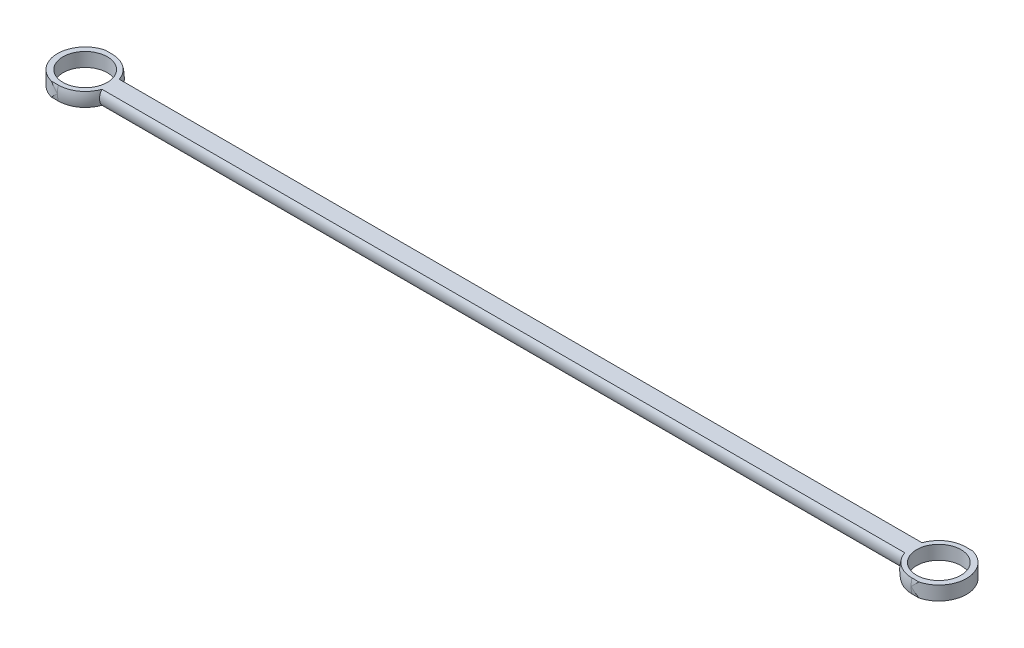
ISO-10303-21;
HEADER;
FILE_DESCRIPTION(('STEP AP214'),'2;1');
FILE_NAME('part.step','',(''),(''),'','','');
FILE_SCHEMA(('AUTOMOTIVE_DESIGN { 1 0 10303 214 1 1 1 1 }'));
ENDSEC;
DATA;
#1=APPLICATION_CONTEXT('core data for automotive mechanical design processes');
#2=APPLICATION_PROTOCOL_DEFINITION('international standard','automotive_design',2000,#1);
#3=PRODUCT_CONTEXT('',#1,'mechanical');
#4=PRODUCT('Part','Part','',(#3));
#5=PRODUCT_RELATED_PRODUCT_CATEGORY('part','',(#4));
#6=PRODUCT_DEFINITION_FORMATION('','',#4);
#7=PRODUCT_DEFINITION_CONTEXT('part definition',#1,'design');
#8=PRODUCT_DEFINITION('design','',#6,#7);
#9=PRODUCT_DEFINITION_SHAPE('','',#8);
#10=(LENGTH_UNIT() NAMED_UNIT(*) SI_UNIT(.MILLI.,.METRE.));
#11=(NAMED_UNIT(*) PLANE_ANGLE_UNIT() SI_UNIT($,.RADIAN.));
#12=(NAMED_UNIT(*) SI_UNIT($,.STERADIAN.) SOLID_ANGLE_UNIT());
#13=UNCERTAINTY_MEASURE_WITH_UNIT(LENGTH_MEASURE(1.E-05),#10,'distance_accuracy_value','');
#14=(GEOMETRIC_REPRESENTATION_CONTEXT(3) GLOBAL_UNCERTAINTY_ASSIGNED_CONTEXT((#13)) GLOBAL_UNIT_ASSIGNED_CONTEXT((#10,
#11,#12)) REPRESENTATION_CONTEXT('',''));
#15=CARTESIAN_POINT('',(0.,0.,0.));
#16=DIRECTION('',(0.,0.,1.));
#17=DIRECTION('',(1.,0.,0.));
#18=AXIS2_PLACEMENT_3D('',#15,#16,#17);
#19=CARTESIAN_POINT('',(180.,-1.25,0.));
#20=DIRECTION('',(0.,1.,0.));
#21=DIRECTION('',(0.,0.,1.));
#22=AXIS2_PLACEMENT_3D('',#19,#20,#21);
#23=PLANE('',#22);
#24=CARTESIAN_POINT('',(13.074176,-1.25,0.));
#25=DIRECTION('',(0.,1.,0.));
#26=DIRECTION('',(0.,0.,1.));
#27=AXIS2_PLACEMENT_3D('',#24,#25,#26);
#28=CIRCLE('',#27,4.);
#29=CARTESIAN_POINT('',(13.074176,-1.25,-3.99999999999998));
#30=VERTEX_POINT('',#29);
#31=EDGE_CURVE('E271',#30,#30,#28,.F.);
#32=ORIENTED_EDGE('',*,*,#31,.F.);
#33=EDGE_LOOP('',(#32));
#34=FACE_BOUND('',#33,.T.);
#35=CARTESIAN_POINT('',(13.074176,-1.25,0.));
#36=DIRECTION('',(0.,1.,0.));
#37=DIRECTION('',(0.,0.,1.));
#38=AXIS2_PLACEMENT_3D('',#35,#36,#37);
#39=CIRCLE('',#38,4.84122918275926);
#40=CARTESIAN_POINT('',(17.6567516949559,-1.24999999999999,-1.56124949959958));
#41=VERTEX_POINT('',#40);
#42=CARTESIAN_POINT('',(13.074176,-1.24999999999999,-4.84122918275924));
#43=VERTEX_POINT('',#42);
#44=EDGE_CURVE('E258',#41,#43,#39,.T.);
#45=ORIENTED_EDGE('',*,*,#44,.F.);
#46=DIRECTION('',(-1.,0.,0.));
#47=VECTOR('',#46,1.);
#48=CARTESIAN_POINT('',(18.074176,-1.25,-1.56124949959958));
#49=LINE('',#48,#47);
#50=CARTESIAN_POINT('',(162.343248305044,-1.24999999999999,-1.56124949959958));
#51=VERTEX_POINT('',#50);
#52=EDGE_CURVE('E247',#41,#51,#49,.F.);
#53=ORIENTED_EDGE('',*,*,#52,.T.);
#54=CARTESIAN_POINT('',(166.925824,-1.25,0.));
#55=DIRECTION('',(0.,-1.,0.));
#56=DIRECTION('',(0.,0.,1.));
#57=AXIS2_PLACEMENT_3D('',#54,#55,#56);
#58=CIRCLE('',#57,4.84122918275926);
#59=CARTESIAN_POINT('',(166.925824,-1.24999999999999,-4.84122918275924));
#60=VERTEX_POINT('',#59);
#61=EDGE_CURVE('E213',#51,#60,#58,.T.);
#62=ORIENTED_EDGE('',*,*,#61,.T.);
#63=DIRECTION('',(1.,0.,0.));
#64=VECTOR('',#63,1.);
#65=CARTESIAN_POINT('',(1.11022302462516E-13,-1.25,-4.84122918275927));
#66=LINE('',#65,#64);
#67=CARTESIAN_POINT('',(168.175824,-1.25,-4.84122918275927));
#68=VERTEX_POINT('',#67);
#69=EDGE_CURVE('E199',#60,#68,#66,.T.);
#70=ORIENTED_EDGE('',*,*,#69,.T.);
#71=CARTESIAN_POINT('',(166.925824,-1.25,0.));
#72=DIRECTION('',(0.,-1.,0.));
#73=DIRECTION('',(0.,0.,1.));
#74=AXIS2_PLACEMENT_3D('',#71,#72,#73);
#75=CIRCLE('',#74,5.);
#76=CARTESIAN_POINT('',(168.175824,-1.25,4.84122918275927));
#77=VERTEX_POINT('',#76);
#78=EDGE_CURVE('E219',#77,#68,#75,.F.);
#79=ORIENTED_EDGE('',*,*,#78,.F.);
#80=DIRECTION('',(1.,0.,0.));
#81=VECTOR('',#80,1.);
#82=CARTESIAN_POINT('',(1.11022302462516E-13,-1.25,4.84122918275927));
#83=LINE('',#82,#81);
#84=CARTESIAN_POINT('',(166.925824,-1.25,4.84122918275928));
#85=VERTEX_POINT('',#84);
#86=EDGE_CURVE('E197',#85,#77,#83,.T.);
#87=ORIENTED_EDGE('',*,*,#86,.F.);
#88=CARTESIAN_POINT('',(162.343248305044,-1.25,1.5612494995996));
#89=VERTEX_POINT('',#88);
#90=EDGE_CURVE('E204',#85,#89,#58,.T.);
#91=ORIENTED_EDGE('',*,*,#90,.T.);
#92=DIRECTION('',(-1.,0.,0.));
#93=VECTOR('',#92,1.);
#94=CARTESIAN_POINT('',(18.074176,-1.25,1.56124949959961));
#95=LINE('',#94,#93);
#96=CARTESIAN_POINT('',(17.6567516949559,-1.25,1.5612494995996));
#97=VERTEX_POINT('',#96);
#98=EDGE_CURVE('E251',#89,#97,#95,.T.);
#99=ORIENTED_EDGE('',*,*,#98,.T.);
#100=CARTESIAN_POINT('',(13.074176,-1.25,4.84122918275928));
#101=VERTEX_POINT('',#100);
#102=EDGE_CURVE('E260',#101,#97,#39,.T.);
#103=ORIENTED_EDGE('',*,*,#102,.F.);
#104=DIRECTION('',(-1.,0.,0.));
#105=VECTOR('',#104,1.);
#106=CARTESIAN_POINT('',(180.,-1.25,4.84122918275927));
#107=LINE('',#106,#105);
#108=CARTESIAN_POINT('',(11.8241760000001,-1.25,4.84122918275927));
#109=VERTEX_POINT('',#108);
#110=EDGE_CURVE('E79',#101,#109,#107,.T.);
#111=ORIENTED_EDGE('',*,*,#110,.T.);
#112=CARTESIAN_POINT('',(13.074176,-1.25,0.));
#113=DIRECTION('',(0.,1.,0.));
#114=DIRECTION('',(0.,0.,1.));
#115=AXIS2_PLACEMENT_3D('',#112,#113,#114);
#116=CIRCLE('',#115,5.);
#117=CARTESIAN_POINT('',(11.8241760000001,-1.25,-4.84122918275927));
#118=VERTEX_POINT('',#117);
#119=EDGE_CURVE('E267',#109,#118,#116,.F.);
#120=ORIENTED_EDGE('',*,*,#119,.T.);
#121=DIRECTION('',(-1.,0.,0.));
#122=VECTOR('',#121,1.);
#123=CARTESIAN_POINT('',(180.,-1.25,-4.84122918275927));
#124=LINE('',#123,#122);
#125=EDGE_CURVE('E87',#43,#118,#124,.T.);
#126=ORIENTED_EDGE('',*,*,#125,.F.);
#127=EDGE_LOOP('',(#45,#53,#62,#70,#79,#87,#91,#99,#103,#111,#120,#126));
#128=FACE_BOUND('',#127,.T.);
#129=CARTESIAN_POINT('',(166.925824,-1.25,0.));
#130=DIRECTION('',(0.,-1.,0.));
#131=DIRECTION('',(0.,0.,1.));
#132=AXIS2_PLACEMENT_3D('',#129,#130,#131);
#133=CIRCLE('',#132,4.);
#134=CARTESIAN_POINT('',(166.925824,-1.25,-3.99999999999998));
#135=VERTEX_POINT('',#134);
#136=EDGE_CURVE('E225',#135,#135,#133,.F.);
#137=ORIENTED_EDGE('',*,*,#136,.T.);
#138=EDGE_LOOP('',(#137));
#139=FACE_BOUND('',#138,.T.);
#140=ADVANCED_FACE('F64',(#34,#128,#139),#23,.F.);
#141=CARTESIAN_POINT('',(180.,0.,0.));
#142=DIRECTION('',(-1.,0.,0.));
#143=DIRECTION('',(0.,0.,1.));
#144=AXIS2_PLACEMENT_3D('',#141,#142,#143);
#145=CYLINDRICAL_SURFACE('',#144,5.);
#146=CARTESIAN_POINT('',(13.074176,0.,0.));
#147=DIRECTION('',(-1.,0.,0.));
#148=DIRECTION('',(0.,0.,1.));
#149=AXIS2_PLACEMENT_3D('',#146,#147,#148);
#150=CIRCLE('',#149,4.99999999999999);
#151=CARTESIAN_POINT('',(13.074176,0.,-4.99999999999997));
#152=VERTEX_POINT('',#151);
#153=EDGE_CURVE('E303',#152,#43,#150,.T.);
#154=ORIENTED_EDGE('',*,*,#153,.T.);
#155=ORIENTED_EDGE('',*,*,#125,.T.);
#156=CARTESIAN_POINT('',(13.0741760000001,0.,0.));
#157=DIRECTION('',(-0.707106781186547,0.707106781186548,0.));
#158=DIRECTION('',(-0.707106781186547,-0.707106781186548,0.));
#159=AXIS2_PLACEMENT_3D('',#156,#157,#158);
#160=ELLIPSE('',#159,7.07106781186547,5.);
#161=EDGE_CURVE('E269',#118,#152,#160,.F.);
#162=ORIENTED_EDGE('',*,*,#161,.T.);
#163=EDGE_LOOP('',(#154,#155,#162));
#164=FACE_BOUND('',#163,.T.);
#165=ADVANCED_FACE('F304',(#164),#145,.T.);
#166=CARTESIAN_POINT('',(13.074176,1.25,-4.84122918275924));
#167=VERTEX_POINT('',#166);
#168=EDGE_CURVE('E241',#167,#152,#150,.T.);
#169=ORIENTED_EDGE('',*,*,#168,.T.);
#170=CARTESIAN_POINT('',(13.0741760000001,0.,0.));
#171=DIRECTION('',(-0.707106781186547,-0.707106781186548,0.));
#172=DIRECTION('',(-0.707106781186547,0.707106781186548,0.));
#173=AXIS2_PLACEMENT_3D('',#170,#171,#172);
#174=ELLIPSE('',#173,7.07106781186547,5.);
#175=CARTESIAN_POINT('',(11.8241760000001,1.25,-4.84122918275927));
#176=VERTEX_POINT('',#175);
#177=EDGE_CURVE('E264',#152,#176,#174,.F.);
#178=ORIENTED_EDGE('',*,*,#177,.T.);
#179=DIRECTION('',(-1.,0.,0.));
#180=VECTOR('',#179,1.);
#181=CARTESIAN_POINT('',(180.,1.25,-4.84122918275927));
#182=LINE('',#181,#180);
#183=EDGE_CURVE('E277',#167,#176,#182,.T.);
#184=ORIENTED_EDGE('',*,*,#183,.F.);
#185=EDGE_LOOP('',(#169,#178,#184));
#186=FACE_BOUND('',#185,.T.);
#187=ADVANCED_FACE('F301',(#186),#145,.T.);
#188=CARTESIAN_POINT('',(180.,1.25,0.));
#189=DIRECTION('',(0.,1.,0.));
#190=DIRECTION('',(0.,0.,1.));
#191=AXIS2_PLACEMENT_3D('',#188,#189,#190);
#192=PLANE('',#191);
#193=CARTESIAN_POINT('',(13.074176,1.25,0.));
#194=DIRECTION('',(0.,1.,0.));
#195=DIRECTION('',(0.,0.,1.));
#196=AXIS2_PLACEMENT_3D('',#193,#194,#195);
#197=CIRCLE('',#196,4.);
#198=CARTESIAN_POINT('',(13.074176,1.25,-3.99999999999998));
#199=VERTEX_POINT('',#198);
#200=EDGE_CURVE('E67',#199,#199,#197,.F.);
#201=ORIENTED_EDGE('',*,*,#200,.T.);
#202=EDGE_LOOP('',(#201));
#203=FACE_BOUND('',#202,.T.);
#204=DIRECTION('',(-1.,0.,0.));
#205=VECTOR('',#204,1.);
#206=CARTESIAN_POINT('',(18.074176,1.25,-1.56124949959958));
#207=LINE('',#206,#205);
#208=CARTESIAN_POINT('',(17.6567516949559,1.24999999999999,-1.56124949959958));
#209=VERTEX_POINT('',#208);
#210=CARTESIAN_POINT('',(162.343248305044,1.24999999999999,-1.56124949959958));
#211=VERTEX_POINT('',#210);
#212=EDGE_CURVE('E245',#209,#211,#207,.F.);
#213=ORIENTED_EDGE('',*,*,#212,.F.);
#214=CARTESIAN_POINT('',(13.074176,1.25,0.));
#215=DIRECTION('',(0.,1.,0.));
#216=DIRECTION('',(0.,0.,1.));
#217=AXIS2_PLACEMENT_3D('',#214,#215,#216);
#218=CIRCLE('',#217,4.84122918275926);
#219=EDGE_CURVE('E254',#209,#167,#218,.T.);
#220=ORIENTED_EDGE('',*,*,#219,.T.);
#221=ORIENTED_EDGE('',*,*,#183,.T.);
#222=CARTESIAN_POINT('',(13.074176,1.25,0.));
#223=DIRECTION('',(0.,1.,0.));
#224=DIRECTION('',(0.,0.,1.));
#225=AXIS2_PLACEMENT_3D('',#222,#223,#224);
#226=CIRCLE('',#225,5.);
#227=CARTESIAN_POINT('',(11.8241760000001,1.25,4.84122918275927));
#228=VERTEX_POINT('',#227);
#229=EDGE_CURVE('E261',#228,#176,#226,.F.);
#230=ORIENTED_EDGE('',*,*,#229,.F.);
#231=DIRECTION('',(-1.,0.,0.));
#232=VECTOR('',#231,1.);
#233=CARTESIAN_POINT('',(180.,1.25,4.84122918275927));
#234=LINE('',#233,#232);
#235=CARTESIAN_POINT('',(13.074176,1.25,4.84122918275928));
#236=VERTEX_POINT('',#235);
#237=EDGE_CURVE('E275',#236,#228,#234,.T.);
#238=ORIENTED_EDGE('',*,*,#237,.F.);
#239=CARTESIAN_POINT('',(17.6567516949559,1.25,1.5612494995996));
#240=VERTEX_POINT('',#239);
#241=EDGE_CURVE('E257',#236,#240,#218,.T.);
#242=ORIENTED_EDGE('',*,*,#241,.T.);
#243=DIRECTION('',(-1.,0.,0.));
#244=VECTOR('',#243,1.);
#245=CARTESIAN_POINT('',(18.074176,1.25,1.56124949959961));
#246=LINE('',#245,#244);
#247=CARTESIAN_POINT('',(162.343248305044,1.25,1.5612494995996));
#248=VERTEX_POINT('',#247);
#249=EDGE_CURVE('E249',#248,#240,#246,.T.);
#250=ORIENTED_EDGE('',*,*,#249,.F.);
#251=CARTESIAN_POINT('',(166.925824,1.25,0.));
#252=DIRECTION('',(0.,-1.,0.));
#253=DIRECTION('',(0.,0.,1.));
#254=AXIS2_PLACEMENT_3D('',#251,#252,#253);
#255=CIRCLE('',#254,4.84122918275926);
#256=CARTESIAN_POINT('',(166.925824,1.25,4.84122918275928));
#257=VERTEX_POINT('',#256);
#258=EDGE_CURVE('E212',#257,#248,#255,.T.);
#259=ORIENTED_EDGE('',*,*,#258,.F.);
#260=DIRECTION('',(1.,0.,0.));
#261=VECTOR('',#260,1.);
#262=CARTESIAN_POINT('',(1.11022302462516E-13,1.25,4.84122918275927));
#263=LINE('',#262,#261);
#264=CARTESIAN_POINT('',(168.175824,1.25,4.84122918275927));
#265=VERTEX_POINT('',#264);
#266=EDGE_CURVE('E184',#257,#265,#263,.T.);
#267=ORIENTED_EDGE('',*,*,#266,.T.);
#268=CARTESIAN_POINT('',(166.925824,1.25,0.));
#269=DIRECTION('',(0.,-1.,0.));
#270=DIRECTION('',(0.,0.,1.));
#271=AXIS2_PLACEMENT_3D('',#268,#269,#270);
#272=CIRCLE('',#271,5.);
#273=CARTESIAN_POINT('',(168.175824,1.25,-4.84122918275927));
#274=VERTEX_POINT('',#273);
#275=EDGE_CURVE('E176',#265,#274,#272,.F.);
#276=ORIENTED_EDGE('',*,*,#275,.T.);
#277=DIRECTION('',(1.,0.,0.));
#278=VECTOR('',#277,1.);
#279=CARTESIAN_POINT('',(1.11022302462516E-13,1.25,-4.84122918275927));
#280=LINE('',#279,#278);
#281=CARTESIAN_POINT('',(166.925824,1.25,-4.84122918275924));
#282=VERTEX_POINT('',#281);
#283=EDGE_CURVE('E230',#282,#274,#280,.T.);
#284=ORIENTED_EDGE('',*,*,#283,.F.);
#285=EDGE_CURVE('E210',#211,#282,#255,.T.);
#286=ORIENTED_EDGE('',*,*,#285,.F.);
#287=EDGE_LOOP('',(#213,#220,#221,#230,#238,#242,#250,#259,#267,#276,#284,#286));
#288=FACE_BOUND('',#287,.T.);
#289=CARTESIAN_POINT('',(166.925824,1.25,0.));
#290=DIRECTION('',(0.,-1.,0.));
#291=DIRECTION('',(0.,0.,1.));
#292=AXIS2_PLACEMENT_3D('',#289,#290,#291);
#293=CIRCLE('',#292,4.);
#294=CARTESIAN_POINT('',(166.925824,1.25,-3.99999999999998));
#295=VERTEX_POINT('',#294);
#296=EDGE_CURVE('E224',#295,#295,#293,.F.);
#297=ORIENTED_EDGE('',*,*,#296,.F.);
#298=EDGE_LOOP('',(#297));
#299=FACE_BOUND('',#298,.T.);
#300=ADVANCED_FACE('F295',(#203,#288,#299),#192,.T.);
#301=CARTESIAN_POINT('',(180.,0.,0.));
#302=DIRECTION('',(-1.,0.,0.));
#303=DIRECTION('',(0.,0.,1.));
#304=AXIS2_PLACEMENT_3D('',#301,#302,#303);
#305=CYLINDRICAL_SURFACE('',#304,5.);
#306=CARTESIAN_POINT('',(13.074176,0.,5.00000000000001));
#307=VERTEX_POINT('',#306);
#308=EDGE_CURVE('E180',#101,#307,#150,.T.);
#309=ORIENTED_EDGE('',*,*,#308,.T.);
#310=CARTESIAN_POINT('',(13.0741760000001,0.,0.));
#311=DIRECTION('',(-0.707106781186547,0.707106781186548,0.));
#312=DIRECTION('',(-0.707106781186547,-0.707106781186548,0.));
#313=AXIS2_PLACEMENT_3D('',#310,#311,#312);
#314=ELLIPSE('',#313,7.07106781186547,5.);
#315=EDGE_CURVE('E72',#307,#109,#314,.F.);
#316=ORIENTED_EDGE('',*,*,#315,.T.);
#317=ORIENTED_EDGE('',*,*,#110,.F.);
#318=EDGE_LOOP('',(#309,#316,#317));
#319=FACE_BOUND('',#318,.T.);
#320=ADVANCED_FACE('F284',(#319),#305,.T.);
#321=EDGE_CURVE('E237',#307,#236,#150,.T.);
#322=ORIENTED_EDGE('',*,*,#321,.T.);
#323=ORIENTED_EDGE('',*,*,#237,.T.);
#324=CARTESIAN_POINT('',(13.0741760000001,0.,0.));
#325=DIRECTION('',(-0.707106781186547,-0.707106781186548,0.));
#326=DIRECTION('',(-0.707106781186547,0.707106781186548,0.));
#327=AXIS2_PLACEMENT_3D('',#324,#325,#326);
#328=ELLIPSE('',#327,7.07106781186547,5.);
#329=EDGE_CURVE('E12',#228,#307,#328,.F.);
#330=ORIENTED_EDGE('',*,*,#329,.T.);
#331=EDGE_LOOP('',(#322,#323,#330));
#332=FACE_BOUND('',#331,.T.);
#333=ADVANCED_FACE('F290',(#332),#305,.T.);
#334=CARTESIAN_POINT('',(13.074176,170.,0.));
#335=DIRECTION('',(0.,-1.,0.));
#336=DIRECTION('',(0.,0.,-1.));
#337=AXIS2_PLACEMENT_3D('',#334,#335,#336);
#338=CYLINDRICAL_SURFACE('',#337,5.);
#339=ORIENTED_EDGE('',*,*,#119,.F.);
#340=ORIENTED_EDGE('',*,*,#315,.F.);
#341=ORIENTED_EDGE('',*,*,#329,.F.);
#342=ORIENTED_EDGE('',*,*,#229,.T.);
#343=ORIENTED_EDGE('',*,*,#177,.F.);
#344=ORIENTED_EDGE('',*,*,#161,.F.);
#345=EDGE_LOOP('',(#339,#340,#341,#342,#343,#344));
#346=FACE_BOUND('',#345,.T.);
#347=ADVANCED_FACE('F287',(#346),#338,.T.);
#348=CARTESIAN_POINT('',(13.074176,170.,0.));
#349=DIRECTION('',(0.,-1.,0.));
#350=DIRECTION('',(0.,0.,-1.));
#351=AXIS2_PLACEMENT_3D('',#348,#349,#350);
#352=CYLINDRICAL_SURFACE('',#351,4.);
#353=CARTESIAN_POINT('',(13.074176,1.25,-3.99999999999998));
#354=CARTESIAN_POINT('',(13.074176,1.22395833333333,-3.99999999999998));
#355=CARTESIAN_POINT('',(13.074176,1.19791666666666,-3.99999999999998));
#356=CARTESIAN_POINT('',(13.074176,1.14583333333333,-3.99999999999998));
#357=CARTESIAN_POINT('',(13.074176,1.11979166666667,-3.99999999999998));
#358=CARTESIAN_POINT('',(13.074176,1.06770833333333,-3.99999999999998));
#359=CARTESIAN_POINT('',(13.074176,1.04166666666666,-3.99999999999998));
#360=CARTESIAN_POINT('',(13.074176,0.989583333333331,-3.99999999999998));
#361=CARTESIAN_POINT('',(13.074176,0.963541666666669,-3.99999999999998));
#362=CARTESIAN_POINT('',(13.074176,0.911458333333337,-3.99999999999998));
#363=CARTESIAN_POINT('',(13.074176,0.885416666666666,-3.99999999999998));
#364=CARTESIAN_POINT('',(13.074176,0.833333333333334,-3.99999999999998));
#365=CARTESIAN_POINT('',(13.074176,0.807291666666673,-3.99999999999998));
#366=CARTESIAN_POINT('',(13.074176,0.75520833333334,-3.99999999999998));
#367=CARTESIAN_POINT('',(13.074176,0.72916666666667,-3.99999999999998));
#368=CARTESIAN_POINT('',(13.074176,0.677083333333337,-3.99999999999998));
#369=CARTESIAN_POINT('',(13.074176,0.651041666666676,-3.99999999999998));
#370=CARTESIAN_POINT('',(13.074176,0.598958333333344,-3.99999999999998));
#371=CARTESIAN_POINT('',(13.074176,0.572916666666673,-3.99999999999998));
#372=CARTESIAN_POINT('',(13.074176,0.520833333333331,-3.99999999999998));
#373=CARTESIAN_POINT('',(13.074176,0.494791666666661,-3.99999999999998));
#374=CARTESIAN_POINT('',(13.074176,0.442708333333329,-3.99999999999998));
#375=CARTESIAN_POINT('',(13.074176,0.416666666666667,-3.99999999999998));
#376=CARTESIAN_POINT('',(13.074176,0.364583333333335,-3.99999999999998));
#377=CARTESIAN_POINT('',(13.074176,0.338541666666664,-3.99999999999998));
#378=CARTESIAN_POINT('',(13.074176,0.286458333333332,-3.99999999999998));
#379=CARTESIAN_POINT('',(13.074176,0.26041666666667,-3.99999999999998));
#380=CARTESIAN_POINT('',(13.074176,0.208333333333338,-3.99999999999998));
#381=CARTESIAN_POINT('',(13.074176,0.182291666666667,-3.99999999999998));
#382=CARTESIAN_POINT('',(13.074176,0.130208333333335,-3.99999999999998));
#383=CARTESIAN_POINT('',(13.074176,0.104166666666674,-3.99999999999998));
#384=CARTESIAN_POINT('',(13.074176,0.0520833333333415,-3.99999999999998));
#385=CARTESIAN_POINT('',(13.074176,0.0260416666666707,-3.99999999999998));
#386=CARTESIAN_POINT('',(13.074176,-0.0260416666666707,-3.99999999999998));
#387=CARTESIAN_POINT('',(13.074176,-0.0520833333333415,-3.99999999999998));
#388=CARTESIAN_POINT('',(13.074176,-0.104166666666674,-3.99999999999998));
#389=CARTESIAN_POINT('',(13.074176,-0.130208333333335,-3.99999999999998));
#390=CARTESIAN_POINT('',(13.074176,-0.182291666666667,-3.99999999999998));
#391=CARTESIAN_POINT('',(13.074176,-0.208333333333338,-3.99999999999998));
#392=CARTESIAN_POINT('',(13.074176,-0.26041666666667,-3.99999999999998));
#393=CARTESIAN_POINT('',(13.074176,-0.286458333333332,-3.99999999999998));
#394=CARTESIAN_POINT('',(13.074176,-0.338541666666664,-3.99999999999998));
#395=CARTESIAN_POINT('',(13.074176,-0.364583333333335,-3.99999999999998));
#396=CARTESIAN_POINT('',(13.074176,-0.416666666666667,-3.99999999999998));
#397=CARTESIAN_POINT('',(13.074176,-0.442708333333329,-3.99999999999998));
#398=CARTESIAN_POINT('',(13.074176,-0.494791666666661,-3.99999999999998));
#399=CARTESIAN_POINT('',(13.074176,-0.520833333333331,-3.99999999999998));
#400=CARTESIAN_POINT('',(13.074176,-0.572916666666673,-3.99999999999998));
#401=CARTESIAN_POINT('',(13.074176,-0.598958333333344,-3.99999999999998));
#402=CARTESIAN_POINT('',(13.074176,-0.651041666666676,-3.99999999999998));
#403=CARTESIAN_POINT('',(13.074176,-0.677083333333337,-3.99999999999998));
#404=CARTESIAN_POINT('',(13.074176,-0.72916666666667,-3.99999999999998));
#405=CARTESIAN_POINT('',(13.074176,-0.75520833333334,-3.99999999999998));
#406=CARTESIAN_POINT('',(13.074176,-0.807291666666673,-3.99999999999998));
#407=CARTESIAN_POINT('',(13.074176,-0.833333333333334,-3.99999999999998));
#408=CARTESIAN_POINT('',(13.074176,-0.885416666666666,-3.99999999999998));
#409=CARTESIAN_POINT('',(13.074176,-0.911458333333337,-3.99999999999998));
#410=CARTESIAN_POINT('',(13.074176,-0.963541666666669,-3.99999999999998));
#411=CARTESIAN_POINT('',(13.074176,-0.989583333333331,-3.99999999999998));
#412=CARTESIAN_POINT('',(13.074176,-1.04166666666666,-3.99999999999998));
#413=CARTESIAN_POINT('',(13.074176,-1.06770833333333,-3.99999999999998));
#414=CARTESIAN_POINT('',(13.074176,-1.11979166666667,-3.99999999999998));
#415=CARTESIAN_POINT('',(13.074176,-1.14583333333333,-3.99999999999998));
#416=CARTESIAN_POINT('',(13.074176,-1.19791666666666,-3.99999999999998));
#417=CARTESIAN_POINT('',(13.074176,-1.22395833333333,-3.99999999999998));
#418=CARTESIAN_POINT('',(13.074176,-1.25,-3.99999999999998));
#419=B_SPLINE_CURVE_WITH_KNOTS('',3,(#353,#354,#355,#356,#357,#358,#359,#360,#361,#362,#363,
#364,#365,#366,#367,#368,#369,#370,#371,#372,#373,#374,#375,#376,#377,#378,#379,#380,#381,#382,
#383,#384,#385,#386,#387,#388,#389,#390,#391,#392,#393,#394,#395,#396,#397,#398,#399,#400,#401,
#402,#403,#404,#405,#406,#407,#408,#409,#410,#411,#412,#413,#414,#415,#416,#417,#418),
.UNSPECIFIED.,.F.,.F.,(4,2,2,2,2,2,2,2,2,2,2,2,2,2,2,2,2,2,2,2,2,2,2,2,2,2,2,2,2,2,2,2,4),(0.,
0.0781250000000122,0.156249999999997,0.234375000000009,0.312499999999993,0.390625000000006,
0.46874999999999,0.546875000000002,0.624999999999987,0.703124999999999,0.781250000000011,
0.859374999999996,0.937500000000008,1.01562499999999,1.09375,1.17187499999999,1.25,
1.32812500000001,1.40625,1.48437500000001,1.56249999999999,1.64062500000001,1.71874999999999,
1.796875,1.87500000000002,1.953125,2.03125000000001,2.109375,2.18750000000001,2.26562499999999,
2.34375000000001,2.42187499999999,2.5),.UNSPECIFIED.);
#420=EDGE_CURVE('BSEAM343',#199,#30,#419,.T.);
#421=ORIENTED_EDGE('',*,*,#200,.F.);
#422=ORIENTED_EDGE('',*,*,#31,.T.);
#423=ORIENTED_EDGE('',*,*,#420,.T.);
#424=ORIENTED_EDGE('',*,*,#420,.F.);
#425=EDGE_LOOP('',(#421,#423,#422,#424));
#426=FACE_BOUND('',#425,.T.);
#427=ADVANCED_FACE('F343',(#426),#352,.F.);
#428=CARTESIAN_POINT('',(18.074176,0.,0.));
#429=DIRECTION('',(-1.,0.,0.));
#430=DIRECTION('',(0.,0.,1.));
#431=AXIS2_PLACEMENT_3D('',#428,#429,#430);
#432=CYLINDRICAL_SURFACE('',#431,2.);
#433=CARTESIAN_POINT('',(17.6567516949559,0.,0.));
#434=DIRECTION('',(-1.,0.,0.));
#435=DIRECTION('',(0.,0.,1.));
#436=AXIS2_PLACEMENT_3D('',#433,#434,#435);
#437=CIRCLE('',#436,1.99999999999999);
#438=EDGE_CURVE('E244',#209,#41,#437,.T.);
#439=ORIENTED_EDGE('',*,*,#438,.F.);
#440=ORIENTED_EDGE('',*,*,#212,.T.);
#441=CARTESIAN_POINT('',(162.343248305044,0.,0.));
#442=DIRECTION('',(-1.,0.,0.));
#443=DIRECTION('',(0.,0.,1.));
#444=AXIS2_PLACEMENT_3D('',#441,#442,#443);
#445=CIRCLE('',#444,1.99999999999999);
#446=EDGE_CURVE('E209',#211,#51,#445,.T.);
#447=ORIENTED_EDGE('',*,*,#446,.T.);
#448=ORIENTED_EDGE('',*,*,#52,.F.);
#449=EDGE_LOOP('',(#439,#440,#447,#448));
#450=FACE_BOUND('',#449,.T.);
#451=ADVANCED_FACE('F312',(#450),#432,.T.);
#452=CARTESIAN_POINT('',(13.074176,0.,0.));
#453=DIRECTION('',(-1.,0.,0.));
#454=DIRECTION('',(0.,0.,1.));
#455=AXIS2_PLACEMENT_3D('',#452,#453,#454);
#456=SPHERICAL_SURFACE('',#455,4.99999999999999);
#457=ORIENTED_EDGE('',*,*,#44,.T.);
#458=ORIENTED_EDGE('',*,*,#153,.F.);
#459=ORIENTED_EDGE('',*,*,#168,.F.);
#460=ORIENTED_EDGE('',*,*,#219,.F.);
#461=ORIENTED_EDGE('',*,*,#438,.T.);
#462=EDGE_LOOP('',(#457,#458,#459,#460,#461));
#463=FACE_BOUND('',#462,.T.);
#464=ADVANCED_FACE('F309',(#463),#456,.T.);
#465=ORIENTED_EDGE('',*,*,#102,.T.);
#466=EDGE_CURVE('E240',#97,#240,#437,.T.);
#467=ORIENTED_EDGE('',*,*,#466,.T.);
#468=ORIENTED_EDGE('',*,*,#241,.F.);
#469=ORIENTED_EDGE('',*,*,#321,.F.);
#470=ORIENTED_EDGE('',*,*,#308,.F.);
#471=EDGE_LOOP('',(#465,#467,#468,#469,#470));
#472=FACE_BOUND('',#471,.T.);
#473=ADVANCED_FACE('F417',(#472),#456,.T.);
#474=ORIENTED_EDGE('',*,*,#98,.F.);
#475=EDGE_CURVE('E189',#89,#248,#445,.T.);
#476=ORIENTED_EDGE('',*,*,#475,.T.);
#477=ORIENTED_EDGE('',*,*,#249,.T.);
#478=ORIENTED_EDGE('',*,*,#466,.F.);
#479=EDGE_LOOP('',(#474,#476,#477,#478));
#480=FACE_BOUND('',#479,.T.);
#481=ADVANCED_FACE('F334',(#480),#432,.T.);
#482=CARTESIAN_POINT('',(1.11022302462516E-13,0.,0.));
#483=DIRECTION('',(1.,0.,0.));
#484=DIRECTION('',(0.,0.,1.));
#485=AXIS2_PLACEMENT_3D('',#482,#483,#484);
#486=CYLINDRICAL_SURFACE('',#485,5.);
#487=CARTESIAN_POINT('',(166.925824,0.,0.));
#488=DIRECTION('',(-1.,0.,0.));
#489=DIRECTION('',(0.,0.,1.));
#490=AXIS2_PLACEMENT_3D('',#487,#488,#489);
#491=CIRCLE('',#490,4.99999999999999);
#492=CARTESIAN_POINT('',(166.925824,0.,-4.99999999999997));
#493=VERTEX_POINT('',#492);
#494=EDGE_CURVE('E205',#493,#60,#491,.T.);
#495=ORIENTED_EDGE('',*,*,#494,.F.);
#496=CARTESIAN_POINT('',(166.925824,0.,0.));
#497=DIRECTION('',(-0.707106781186547,-0.707106781186548,0.));
#498=DIRECTION('',(0.707106781186547,-0.707106781186548,0.));
#499=AXIS2_PLACEMENT_3D('',#496,#497,#498);
#500=ELLIPSE('',#499,7.07106781186547,5.);
#501=EDGE_CURVE('E221',#68,#493,#500,.F.);
#502=ORIENTED_EDGE('',*,*,#501,.F.);
#503=ORIENTED_EDGE('',*,*,#69,.F.);
#504=EDGE_LOOP('',(#495,#502,#503));
#505=FACE_BOUND('',#504,.T.);
#506=ADVANCED_FACE('F324',(#505),#486,.T.);
#507=EDGE_CURVE('E190',#282,#493,#491,.T.);
#508=ORIENTED_EDGE('',*,*,#507,.F.);
#509=ORIENTED_EDGE('',*,*,#283,.T.);
#510=CARTESIAN_POINT('',(166.925824,0.,0.));
#511=DIRECTION('',(-0.707106781186547,0.707106781186548,0.));
#512=DIRECTION('',(0.707106781186547,0.707106781186548,0.));
#513=AXIS2_PLACEMENT_3D('',#510,#511,#512);
#514=ELLIPSE('',#513,7.07106781186547,5.);
#515=EDGE_CURVE('E217',#493,#274,#514,.F.);
#516=ORIENTED_EDGE('',*,*,#515,.F.);
#517=EDGE_LOOP('',(#508,#509,#516));
#518=FACE_BOUND('',#517,.T.);
#519=ADVANCED_FACE('F326',(#518),#486,.T.);
#520=CARTESIAN_POINT('',(1.11022302462516E-13,0.,0.));
#521=DIRECTION('',(1.,0.,0.));
#522=DIRECTION('',(0.,0.,1.));
#523=AXIS2_PLACEMENT_3D('',#520,#521,#522);
#524=CYLINDRICAL_SURFACE('',#523,5.);
#525=CARTESIAN_POINT('',(166.925824,0.,5.00000000000001));
#526=VERTEX_POINT('',#525);
#527=EDGE_CURVE('E192',#85,#526,#491,.T.);
#528=ORIENTED_EDGE('',*,*,#527,.F.);
#529=ORIENTED_EDGE('',*,*,#86,.T.);
#530=CARTESIAN_POINT('',(166.925824,0.,0.));
#531=DIRECTION('',(-0.707106781186547,-0.707106781186548,0.));
#532=DIRECTION('',(0.707106781186547,-0.707106781186548,0.));
#533=AXIS2_PLACEMENT_3D('',#530,#531,#532);
#534=ELLIPSE('',#533,7.07106781186547,5.);
#535=EDGE_CURVE('E173',#526,#77,#534,.F.);
#536=ORIENTED_EDGE('',*,*,#535,.F.);
#537=EDGE_LOOP('',(#528,#529,#536));
#538=FACE_BOUND('',#537,.T.);
#539=ADVANCED_FACE('F194',(#538),#524,.T.);
#540=EDGE_CURVE('E182',#526,#257,#491,.T.);
#541=ORIENTED_EDGE('',*,*,#540,.F.);
#542=CARTESIAN_POINT('',(166.925824,0.,0.));
#543=DIRECTION('',(-0.707106781186547,0.707106781186548,0.));
#544=DIRECTION('',(0.707106781186547,0.707106781186548,0.));
#545=AXIS2_PLACEMENT_3D('',#542,#543,#544);
#546=ELLIPSE('',#545,7.07106781186547,5.);
#547=EDGE_CURVE('E168',#265,#526,#546,.F.);
#548=ORIENTED_EDGE('',*,*,#547,.F.);
#549=ORIENTED_EDGE('',*,*,#266,.F.);
#550=EDGE_LOOP('',(#541,#548,#549));
#551=FACE_BOUND('',#550,.T.);
#552=ADVANCED_FACE('F183',(#551),#524,.T.);
#553=CARTESIAN_POINT('',(166.925824,170.,0.));
#554=DIRECTION('',(0.,-1.,0.));
#555=DIRECTION('',(0.,0.,-1.));
#556=AXIS2_PLACEMENT_3D('',#553,#554,#555);
#557=CYLINDRICAL_SURFACE('',#556,5.);
#558=ORIENTED_EDGE('',*,*,#78,.T.);
#559=ORIENTED_EDGE('',*,*,#501,.T.);
#560=ORIENTED_EDGE('',*,*,#515,.T.);
#561=ORIENTED_EDGE('',*,*,#275,.F.);
#562=ORIENTED_EDGE('',*,*,#547,.T.);
#563=ORIENTED_EDGE('',*,*,#535,.T.);
#564=EDGE_LOOP('',(#558,#559,#560,#561,#562,#563));
#565=FACE_BOUND('',#564,.T.);
#566=ADVANCED_FACE('F171',(#565),#557,.T.);
#567=CARTESIAN_POINT('',(166.925824,170.,0.));
#568=DIRECTION('',(0.,-1.,0.));
#569=DIRECTION('',(0.,0.,-1.));
#570=AXIS2_PLACEMENT_3D('',#567,#568,#569);
#571=CYLINDRICAL_SURFACE('',#570,4.);
#572=CARTESIAN_POINT('',(166.925824,1.25,-3.99999999999998));
#573=CARTESIAN_POINT('',(166.925824,1.22395833333333,-3.99999999999998));
#574=CARTESIAN_POINT('',(166.925824,1.19791666666666,-3.99999999999998));
#575=CARTESIAN_POINT('',(166.925824,1.14583333333333,-3.99999999999998));
#576=CARTESIAN_POINT('',(166.925824,1.11979166666667,-3.99999999999998));
#577=CARTESIAN_POINT('',(166.925824,1.06770833333333,-3.99999999999998));
#578=CARTESIAN_POINT('',(166.925824,1.04166666666666,-3.99999999999998));
#579=CARTESIAN_POINT('',(166.925824,0.989583333333331,-3.99999999999998));
#580=CARTESIAN_POINT('',(166.925824,0.963541666666669,-3.99999999999998));
#581=CARTESIAN_POINT('',(166.925824,0.911458333333337,-3.99999999999998));
#582=CARTESIAN_POINT('',(166.925824,0.885416666666666,-3.99999999999998));
#583=CARTESIAN_POINT('',(166.925824,0.833333333333334,-3.99999999999998));
#584=CARTESIAN_POINT('',(166.925824,0.807291666666673,-3.99999999999998));
#585=CARTESIAN_POINT('',(166.925824,0.75520833333334,-3.99999999999998));
#586=CARTESIAN_POINT('',(166.925824,0.72916666666667,-3.99999999999998));
#587=CARTESIAN_POINT('',(166.925824,0.677083333333337,-3.99999999999998));
#588=CARTESIAN_POINT('',(166.925824,0.651041666666676,-3.99999999999998));
#589=CARTESIAN_POINT('',(166.925824,0.598958333333344,-3.99999999999998));
#590=CARTESIAN_POINT('',(166.925824,0.572916666666673,-3.99999999999998));
#591=CARTESIAN_POINT('',(166.925824,0.520833333333331,-3.99999999999998));
#592=CARTESIAN_POINT('',(166.925824,0.494791666666661,-3.99999999999998));
#593=CARTESIAN_POINT('',(166.925824,0.442708333333329,-3.99999999999998));
#594=CARTESIAN_POINT('',(166.925824,0.416666666666667,-3.99999999999998));
#595=CARTESIAN_POINT('',(166.925824,0.364583333333335,-3.99999999999998));
#596=CARTESIAN_POINT('',(166.925824,0.338541666666664,-3.99999999999998));
#597=CARTESIAN_POINT('',(166.925824,0.286458333333332,-3.99999999999998));
#598=CARTESIAN_POINT('',(166.925824,0.26041666666667,-3.99999999999998));
#599=CARTESIAN_POINT('',(166.925824,0.208333333333338,-3.99999999999998));
#600=CARTESIAN_POINT('',(166.925824,0.182291666666667,-3.99999999999998));
#601=CARTESIAN_POINT('',(166.925824,0.130208333333335,-3.99999999999998));
#602=CARTESIAN_POINT('',(166.925824,0.104166666666674,-3.99999999999998));
#603=CARTESIAN_POINT('',(166.925824,0.0520833333333415,-3.99999999999998));
#604=CARTESIAN_POINT('',(166.925824,0.0260416666666707,-3.99999999999998));
#605=CARTESIAN_POINT('',(166.925824,-0.0260416666666707,-3.99999999999998));
#606=CARTESIAN_POINT('',(166.925824,-0.0520833333333415,-3.99999999999998));
#607=CARTESIAN_POINT('',(166.925824,-0.104166666666674,-3.99999999999998));
#608=CARTESIAN_POINT('',(166.925824,-0.130208333333335,-3.99999999999998));
#609=CARTESIAN_POINT('',(166.925824,-0.182291666666667,-3.99999999999998));
#610=CARTESIAN_POINT('',(166.925824,-0.208333333333338,-3.99999999999998));
#611=CARTESIAN_POINT('',(166.925824,-0.26041666666667,-3.99999999999998));
#612=CARTESIAN_POINT('',(166.925824,-0.286458333333332,-3.99999999999998));
#613=CARTESIAN_POINT('',(166.925824,-0.338541666666664,-3.99999999999998));
#614=CARTESIAN_POINT('',(166.925824,-0.364583333333335,-3.99999999999998));
#615=CARTESIAN_POINT('',(166.925824,-0.416666666666667,-3.99999999999998));
#616=CARTESIAN_POINT('',(166.925824,-0.442708333333329,-3.99999999999998));
#617=CARTESIAN_POINT('',(166.925824,-0.494791666666661,-3.99999999999998));
#618=CARTESIAN_POINT('',(166.925824,-0.520833333333331,-3.99999999999998));
#619=CARTESIAN_POINT('',(166.925824,-0.572916666666673,-3.99999999999998));
#620=CARTESIAN_POINT('',(166.925824,-0.598958333333344,-3.99999999999998));
#621=CARTESIAN_POINT('',(166.925824,-0.651041666666676,-3.99999999999998));
#622=CARTESIAN_POINT('',(166.925824,-0.677083333333337,-3.99999999999998));
#623=CARTESIAN_POINT('',(166.925824,-0.72916666666667,-3.99999999999998));
#624=CARTESIAN_POINT('',(166.925824,-0.75520833333334,-3.99999999999998));
#625=CARTESIAN_POINT('',(166.925824,-0.807291666666673,-3.99999999999998));
#626=CARTESIAN_POINT('',(166.925824,-0.833333333333334,-3.99999999999998));
#627=CARTESIAN_POINT('',(166.925824,-0.885416666666666,-3.99999999999998));
#628=CARTESIAN_POINT('',(166.925824,-0.911458333333337,-3.99999999999998));
#629=CARTESIAN_POINT('',(166.925824,-0.963541666666669,-3.99999999999998));
#630=CARTESIAN_POINT('',(166.925824,-0.989583333333331,-3.99999999999998));
#631=CARTESIAN_POINT('',(166.925824,-1.04166666666666,-3.99999999999998));
#632=CARTESIAN_POINT('',(166.925824,-1.06770833333333,-3.99999999999998));
#633=CARTESIAN_POINT('',(166.925824,-1.11979166666667,-3.99999999999998));
#634=CARTESIAN_POINT('',(166.925824,-1.14583333333333,-3.99999999999998));
#635=CARTESIAN_POINT('',(166.925824,-1.19791666666666,-3.99999999999998));
#636=CARTESIAN_POINT('',(166.925824,-1.22395833333333,-3.99999999999998));
#637=CARTESIAN_POINT('',(166.925824,-1.25,-3.99999999999998));
#638=B_SPLINE_CURVE_WITH_KNOTS('',3,(#572,#573,#574,#575,#576,#577,#578,#579,#580,#581,#582,
#583,#584,#585,#586,#587,#588,#589,#590,#591,#592,#593,#594,#595,#596,#597,#598,#599,#600,#601,
#602,#603,#604,#605,#606,#607,#608,#609,#610,#611,#612,#613,#614,#615,#616,#617,#618,#619,#620,
#621,#622,#623,#624,#625,#626,#627,#628,#629,#630,#631,#632,#633,#634,#635,#636,#637),
.UNSPECIFIED.,.F.,.F.,(4,2,2,2,2,2,2,2,2,2,2,2,2,2,2,2,2,2,2,2,2,2,2,2,2,2,2,2,2,2,2,2,4),(0.,
0.0781250000000122,0.156249999999997,0.234375000000009,0.312499999999993,0.390625000000006,
0.46874999999999,0.546875000000002,0.624999999999987,0.703124999999999,0.781250000000011,
0.859374999999996,0.937500000000008,1.01562499999999,1.09375,1.17187499999999,1.25,
1.32812500000001,1.40625,1.48437500000001,1.56249999999999,1.64062500000001,1.71874999999999,
1.796875,1.87500000000002,1.953125,2.03125000000001,2.109375,2.18750000000001,2.26562499999999,
2.34375000000001,2.42187499999999,2.5),.UNSPECIFIED.);
#639=EDGE_CURVE('BSEAM448',#295,#135,#638,.T.);
#640=ORIENTED_EDGE('',*,*,#296,.T.);
#641=ORIENTED_EDGE('',*,*,#136,.F.);
#642=ORIENTED_EDGE('',*,*,#639,.T.);
#643=ORIENTED_EDGE('',*,*,#639,.F.);
#644=EDGE_LOOP('',(#640,#642,#641,#643));
#645=FACE_BOUND('',#644,.T.);
#646=ADVANCED_FACE('F448',(#645),#571,.F.);
#647=CARTESIAN_POINT('',(166.925824,0.,0.));
#648=DIRECTION('',(1.,0.,0.));
#649=DIRECTION('',(0.,0.,1.));
#650=AXIS2_PLACEMENT_3D('',#647,#648,#649);
#651=SPHERICAL_SURFACE('',#650,4.99999999999999);
#652=ORIENTED_EDGE('',*,*,#61,.F.);
#653=ORIENTED_EDGE('',*,*,#446,.F.);
#654=ORIENTED_EDGE('',*,*,#285,.T.);
#655=ORIENTED_EDGE('',*,*,#507,.T.);
#656=ORIENTED_EDGE('',*,*,#494,.T.);
#657=EDGE_LOOP('',(#652,#653,#654,#655,#656));
#658=FACE_BOUND('',#657,.T.);
#659=ADVANCED_FACE('F320',(#658),#651,.T.);
#660=ORIENTED_EDGE('',*,*,#90,.F.);
#661=ORIENTED_EDGE('',*,*,#527,.T.);
#662=ORIENTED_EDGE('',*,*,#540,.T.);
#663=ORIENTED_EDGE('',*,*,#258,.T.);
#664=ORIENTED_EDGE('',*,*,#475,.F.);
#665=EDGE_LOOP('',(#660,#661,#662,#663,#664));
#666=FACE_BOUND('',#665,.T.);
#667=ADVANCED_FACE('F201',(#666),#651,.T.);
#668=CLOSED_SHELL('',(#140,#165,#187,#300,#320,#333,#347,#427,#451,#464,#473,#481,#506,#519,
#539,#552,#566,#646,#659,#667));
#669=MANIFOLD_SOLID_BREP('B2',#668);
#670=ADVANCED_BREP_SHAPE_REPRESENTATION('',(#18,#669),#14);
#671=SHAPE_DEFINITION_REPRESENTATION(#9,#670);
ENDSEC;
END-ISO-10303-21;
